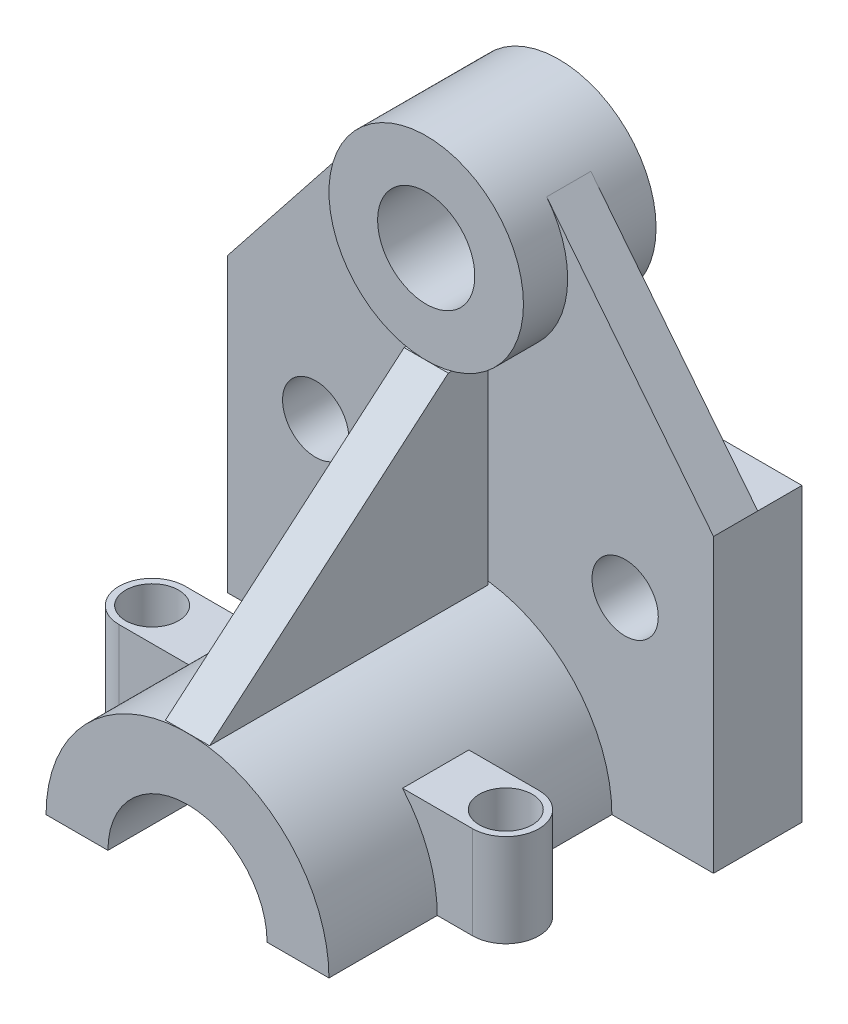
ISO-10303-21;
HEADER;
FILE_DESCRIPTION(('STEP AP214'),'2;1');
FILE_NAME('part.step','',(''),(''),'','','');
FILE_SCHEMA(('AUTOMOTIVE_DESIGN { 1 0 10303 214 1 1 1 1 }'));
ENDSEC;
DATA;
#1=APPLICATION_CONTEXT('core data for automotive mechanical design processes');
#2=APPLICATION_PROTOCOL_DEFINITION('international standard','automotive_design',2000,#1);
#3=PRODUCT_CONTEXT('',#1,'mechanical');
#4=PRODUCT('Part','Part','',(#3));
#5=PRODUCT_RELATED_PRODUCT_CATEGORY('part','',(#4));
#6=PRODUCT_DEFINITION_FORMATION('','',#4);
#7=PRODUCT_DEFINITION_CONTEXT('part definition',#1,'design');
#8=PRODUCT_DEFINITION('design','',#6,#7);
#9=PRODUCT_DEFINITION_SHAPE('','',#8);
#10=(LENGTH_UNIT() NAMED_UNIT(*) SI_UNIT(.MILLI.,.METRE.));
#11=(NAMED_UNIT(*) PLANE_ANGLE_UNIT() SI_UNIT($,.RADIAN.));
#12=(NAMED_UNIT(*) SI_UNIT($,.STERADIAN.) SOLID_ANGLE_UNIT());
#13=UNCERTAINTY_MEASURE_WITH_UNIT(LENGTH_MEASURE(1.E-05),#10,'distance_accuracy_value','');
#14=(GEOMETRIC_REPRESENTATION_CONTEXT(3) GLOBAL_UNCERTAINTY_ASSIGNED_CONTEXT((#13)) GLOBAL_UNIT_ASSIGNED_CONTEXT((#10,
#11,#12)) REPRESENTATION_CONTEXT('',''));
#15=CARTESIAN_POINT('',(0.,0.,0.));
#16=DIRECTION('',(0.,0.,1.));
#17=DIRECTION('',(1.,0.,0.));
#18=AXIS2_PLACEMENT_3D('',#15,#16,#17);
#19=CARTESIAN_POINT('',(-5.,-0.999999999999994,0.));
#20=DIRECTION('',(0.,1.,0.));
#21=DIRECTION('',(-1.,0.,0.));
#22=AXIS2_PLACEMENT_3D('',#19,#20,#21);
#23=PLANE('',#22);
#24=DIRECTION('',(0.,0.,1.));
#25=VECTOR('',#24,1.);
#26=CARTESIAN_POINT('',(-5.,-0.999999999999994,0.));
#27=LINE('',#26,#25);
#28=CARTESIAN_POINT('',(-5.,-0.999999999999994,1.00000000000001));
#29=VERTEX_POINT('',#28);
#30=CARTESIAN_POINT('',(-5.,-1.,64.));
#31=VERTEX_POINT('',#30);
#32=EDGE_CURVE('E84',#29,#31,#27,.T.);
#33=ORIENTED_EDGE('',*,*,#32,.F.);
#34=DIRECTION('',(-1.,0.,0.));
#35=VECTOR('',#34,1.);
#36=CARTESIAN_POINT('',(4.99999999999996,-0.999999999999994,1.00000000000001));
#37=LINE('',#36,#35);
#38=CARTESIAN_POINT('',(4.99999999999996,-0.999999999999994,1.00000000000001));
#39=VERTEX_POINT('',#38);
#40=EDGE_CURVE('E119',#39,#29,#37,.T.);
#41=ORIENTED_EDGE('',*,*,#40,.F.);
#42=DIRECTION('',(0.,0.,1.));
#43=VECTOR('',#42,1.);
#44=CARTESIAN_POINT('',(4.99999999999997,-0.999999999999994,0.));
#45=LINE('',#44,#43);
#46=CARTESIAN_POINT('',(4.99999999999997,-1.,64.));
#47=VERTEX_POINT('',#46);
#48=EDGE_CURVE('E108',#39,#47,#45,.T.);
#49=ORIENTED_EDGE('',*,*,#48,.T.);
#50=DIRECTION('',(1.,0.,0.));
#51=VECTOR('',#50,1.);
#52=CARTESIAN_POINT('',(-5.,-1.,64.));
#53=LINE('',#52,#51);
#54=EDGE_CURVE('E13',#31,#47,#53,.T.);
#55=ORIENTED_EDGE('',*,*,#54,.F.);
#56=EDGE_LOOP('',(#33,#41,#49,#55));
#57=FACE_BOUND('',#56,.T.);
#58=ADVANCED_FACE('F70',(#57),#23,.F.);
#59=CARTESIAN_POINT('',(-5.,31.0135132931716,26.4189176747606));
#60=DIRECTION('',(0.,0.761243243287488,0.648466440572792));
#61=DIRECTION('',(0.,-0.648466440572792,0.761243243287488));
#62=AXIS2_PLACEMENT_3D('',#59,#60,#61);
#63=PLANE('',#62);
#64=ORIENTED_EDGE('',*,*,#54,.T.);
#65=DIRECTION('',(0.,-0.648466440572792,0.761243243287488));
#66=VECTOR('',#65,1.);
#67=CARTESIAN_POINT('',(4.99999999999996,31.0135132931716,26.4189176747606));
#68=LINE('',#67,#66);
#69=CARTESIAN_POINT('',(4.99999999999996,44.9999981605174,9.99999999999999));
#70=VERTEX_POINT('',#69);
#71=EDGE_CURVE('E114',#70,#47,#68,.T.);
#72=ORIENTED_EDGE('',*,*,#71,.F.);
#73=DIRECTION('',(1.,0.,0.));
#74=VECTOR('',#73,1.);
#75=CARTESIAN_POINT('',(-5.,44.9999981605174,9.99999999999999));
#76=LINE('',#75,#74);
#77=CARTESIAN_POINT('',(-5.,44.9999981605174,9.99999999999999));
#78=VERTEX_POINT('',#77);
#79=EDGE_CURVE('E73',#78,#70,#76,.T.);
#80=ORIENTED_EDGE('',*,*,#79,.F.);
#81=DIRECTION('',(0.,-0.648466440572792,0.761243243287488));
#82=VECTOR('',#81,1.);
#83=CARTESIAN_POINT('',(-5.,31.0135132931716,26.4189176747606));
#84=LINE('',#83,#82);
#85=EDGE_CURVE('E137',#78,#31,#84,.T.);
#86=ORIENTED_EDGE('',*,*,#85,.T.);
#87=EDGE_LOOP('',(#64,#72,#80,#86));
#88=FACE_BOUND('',#87,.T.);
#89=ADVANCED_FACE('F143',(#88),#63,.T.);
#90=CARTESIAN_POINT('',(-5.,0.,0.));
#91=DIRECTION('',(1.,0.,0.));
#92=DIRECTION('',(0.,1.,0.));
#93=AXIS2_PLACEMENT_3D('',#90,#91,#92);
#94=PLANE('',#93);
#95=ORIENTED_EDGE('',*,*,#32,.T.);
#96=ORIENTED_EDGE('',*,*,#85,.F.);
#97=DIRECTION('',(0.,0.,1.));
#98=VECTOR('',#97,1.);
#99=CARTESIAN_POINT('',(-5.,44.9999981605174,1.00000000000001));
#100=LINE('',#99,#98);
#101=CARTESIAN_POINT('',(-5.,44.9999981605174,1.00000000000001));
#102=VERTEX_POINT('',#101);
#103=EDGE_CURVE('E116',#102,#78,#100,.T.);
#104=ORIENTED_EDGE('',*,*,#103,.F.);
#105=DIRECTION('',(0.,1.,0.));
#106=VECTOR('',#105,1.);
#107=CARTESIAN_POINT('',(-5.,44.9999981605174,1.00000000000001));
#108=LINE('',#107,#106);
#109=EDGE_CURVE('E121',#29,#102,#108,.T.);
#110=ORIENTED_EDGE('',*,*,#109,.F.);
#111=EDGE_LOOP('',(#95,#96,#104,#110));
#112=FACE_BOUND('',#111,.T.);
#113=ADVANCED_FACE('F145',(#112),#94,.F.);
#114=CARTESIAN_POINT('',(4.99999999999997,0.,0.));
#115=DIRECTION('',(1.,0.,0.));
#116=DIRECTION('',(0.,1.,0.));
#117=AXIS2_PLACEMENT_3D('',#114,#115,#116);
#118=PLANE('',#117);
#119=ORIENTED_EDGE('',*,*,#48,.F.);
#120=DIRECTION('',(0.,-1.,0.));
#121=VECTOR('',#120,1.);
#122=CARTESIAN_POINT('',(4.99999999999996,44.9999981605174,1.00000000000001));
#123=LINE('',#122,#121);
#124=CARTESIAN_POINT('',(4.99999999999996,44.9999981605174,1.00000000000001));
#125=VERTEX_POINT('',#124);
#126=EDGE_CURVE('E113',#125,#39,#123,.T.);
#127=ORIENTED_EDGE('',*,*,#126,.F.);
#128=DIRECTION('',(0.,0.,1.));
#129=VECTOR('',#128,1.);
#130=CARTESIAN_POINT('',(4.99999999999996,44.9999981605174,1.00000000000001));
#131=LINE('',#130,#129);
#132=EDGE_CURVE('E131',#125,#70,#131,.T.);
#133=ORIENTED_EDGE('',*,*,#132,.T.);
#134=ORIENTED_EDGE('',*,*,#71,.T.);
#135=EDGE_LOOP('',(#119,#127,#133,#134));
#136=FACE_BOUND('',#135,.T.);
#137=ADVANCED_FACE('F110',(#136),#118,.T.);
#138=CARTESIAN_POINT('',(4.99999999999996,44.9999981605174,1.00000000000001));
#139=DIRECTION('',(0.,-1.,0.));
#140=DIRECTION('',(0.,0.,-1.));
#141=AXIS2_PLACEMENT_3D('',#138,#139,#140);
#142=PLANE('',#141);
#143=ORIENTED_EDGE('',*,*,#79,.T.);
#144=ORIENTED_EDGE('',*,*,#132,.F.);
#145=DIRECTION('',(1.,0.,0.));
#146=VECTOR('',#145,1.);
#147=CARTESIAN_POINT('',(4.99999999999996,44.9999981605174,1.00000000000001));
#148=LINE('',#147,#146);
#149=EDGE_CURVE('E125',#102,#125,#148,.T.);
#150=ORIENTED_EDGE('',*,*,#149,.F.);
#151=ORIENTED_EDGE('',*,*,#103,.T.);
#152=EDGE_LOOP('',(#143,#144,#150,#151));
#153=FACE_BOUND('',#152,.T.);
#154=ADVANCED_FACE('F141',(#153),#142,.F.);
#155=CARTESIAN_POINT('',(0.,0.,1.00000000000001));
#156=DIRECTION('',(0.,0.,-1.));
#157=DIRECTION('',(-1.,0.,0.));
#158=AXIS2_PLACEMENT_3D('',#155,#156,#157);
#159=PLANE('',#158);
#160=ORIENTED_EDGE('',*,*,#126,.T.);
#161=ORIENTED_EDGE('',*,*,#40,.T.);
#162=ORIENTED_EDGE('',*,*,#109,.T.);
#163=ORIENTED_EDGE('',*,*,#149,.T.);
#164=EDGE_LOOP('',(#160,#161,#162,#163));
#165=FACE_BOUND('',#164,.T.);
#166=ADVANCED_FACE('F123',(#165),#159,.T.);
#167=CLOSED_SHELL('',(#58,#89,#113,#137,#154,#166));
#168=MANIFOLD_SOLID_BREP('B2',#167);
#169=CARTESIAN_POINT('',(0.,-33.,64.));
#170=DIRECTION('',(0.,0.,-1.));
#171=DIRECTION('',(-1.,0.,0.));
#172=AXIS2_PLACEMENT_3D('',#169,#170,#171);
#173=CYLINDRICAL_SURFACE('',#172,32.);
#174=CARTESIAN_POINT('',(0.,-33.,39.5));
#175=DIRECTION('',(0.,0.,-1.));
#176=DIRECTION('',(-1.,0.,0.));
#177=AXIS2_PLACEMENT_3D('',#174,#175,#176);
#178=CIRCLE('',#177,32.);
#179=CARTESIAN_POINT('',(-32.,-33.,39.5));
#180=VERTEX_POINT('',#179);
#181=CARTESIAN_POINT('',(-24.1453929352993,-12.,39.5));
#182=VERTEX_POINT('',#181);
#183=EDGE_CURVE('E68',#180,#182,#178,.T.);
#184=ORIENTED_EDGE('',*,*,#183,.F.);
#185=DIRECTION('',(0.,0.,-1.));
#186=VECTOR('',#185,1.);
#187=CARTESIAN_POINT('',(-32.,-33.,64.));
#188=LINE('',#187,#186);
#189=CARTESIAN_POINT('',(-32.,-33.,64.));
#190=VERTEX_POINT('',#189);
#191=EDGE_CURVE('E428',#190,#180,#188,.T.);
#192=ORIENTED_EDGE('',*,*,#191,.F.);
#193=CARTESIAN_POINT('',(0.,-33.,64.));
#194=DIRECTION('',(0.,0.,1.));
#195=DIRECTION('',(1.,0.,0.));
#196=AXIS2_PLACEMENT_3D('',#193,#194,#195);
#197=CIRCLE('',#196,32.);
#198=CARTESIAN_POINT('',(32.,-33.,64.));
#199=VERTEX_POINT('',#198);
#200=EDGE_CURVE('E408',#199,#190,#197,.T.);
#201=ORIENTED_EDGE('',*,*,#200,.F.);
#202=DIRECTION('',(0.,0.,-1.));
#203=VECTOR('',#202,1.);
#204=CARTESIAN_POINT('',(32.,-33.,64.));
#205=LINE('',#204,#203);
#206=CARTESIAN_POINT('',(32.,-33.,39.5));
#207=VERTEX_POINT('',#206);
#208=EDGE_CURVE('E510',#199,#207,#205,.T.);
#209=ORIENTED_EDGE('',*,*,#208,.T.);
#210=CARTESIAN_POINT('',(24.1453929352993,-12.,39.5));
#211=VERTEX_POINT('',#210);
#212=EDGE_CURVE('E529',#211,#207,#178,.T.);
#213=ORIENTED_EDGE('',*,*,#212,.F.);
#214=DIRECTION('',(0.,0.,-1.));
#215=VECTOR('',#214,1.);
#216=CARTESIAN_POINT('',(24.1453929352993,-12.,64.));
#217=LINE('',#216,#215);
#218=CARTESIAN_POINT('',(24.1453929352993,-12.,24.5));
#219=VERTEX_POINT('',#218);
#220=EDGE_CURVE('E345',#219,#211,#217,.F.);
#221=ORIENTED_EDGE('',*,*,#220,.F.);
#222=CARTESIAN_POINT('',(0.,-33.,24.5));
#223=DIRECTION('',(0.,0.,-1.));
#224=DIRECTION('',(-1.,0.,0.));
#225=AXIS2_PLACEMENT_3D('',#222,#223,#224);
#226=CIRCLE('',#225,32.);
#227=CARTESIAN_POINT('',(32.,-33.,24.5));
#228=VERTEX_POINT('',#227);
#229=EDGE_CURVE('E231',#219,#228,#226,.T.);
#230=ORIENTED_EDGE('',*,*,#229,.T.);
#231=CARTESIAN_POINT('',(32.,-33.,0.));
#232=VERTEX_POINT('',#231);
#233=EDGE_CURVE('E431',#228,#232,#205,.T.);
#234=ORIENTED_EDGE('',*,*,#233,.T.);
#235=CARTESIAN_POINT('',(0.,-33.,0.));
#236=DIRECTION('',(0.,0.,1.));
#237=DIRECTION('',(1.,0.,0.));
#238=AXIS2_PLACEMENT_3D('',#235,#236,#237);
#239=CIRCLE('',#238,32.);
#240=CARTESIAN_POINT('',(-32.,-33.,0.));
#241=VERTEX_POINT('',#240);
#242=EDGE_CURVE('E406',#232,#241,#239,.T.);
#243=ORIENTED_EDGE('',*,*,#242,.T.);
#244=CARTESIAN_POINT('',(-32.,-33.,24.5));
#245=VERTEX_POINT('',#244);
#246=EDGE_CURVE('E419',#245,#241,#188,.T.);
#247=ORIENTED_EDGE('',*,*,#246,.F.);
#248=CARTESIAN_POINT('',(-24.1453929352993,-12.,24.5));
#249=VERTEX_POINT('',#248);
#250=EDGE_CURVE('E525',#245,#249,#226,.T.);
#251=ORIENTED_EDGE('',*,*,#250,.T.);
#252=DIRECTION('',(0.,0.,-1.));
#253=VECTOR('',#252,1.);
#254=CARTESIAN_POINT('',(-24.1453929352993,-12.,64.));
#255=LINE('',#254,#253);
#256=EDGE_CURVE('E215',#182,#249,#255,.T.);
#257=ORIENTED_EDGE('',*,*,#256,.F.);
#258=EDGE_LOOP('',(#184,#192,#201,#209,#213,#221,#230,#234,#243,#247,#251,#257));
#259=FACE_BOUND('',#258,.T.);
#260=ADVANCED_FACE('F206',(#259),#173,.T.);
#261=CARTESIAN_POINT('',(0.,0.,0.));
#262=DIRECTION('',(0.,0.,1.));
#263=DIRECTION('',(1.,0.,0.));
#264=AXIS2_PLACEMENT_3D('',#261,#262,#263);
#265=PLANE('',#264);
#266=CARTESIAN_POINT('',(-35.,11.,0.));
#267=DIRECTION('',(0.,0.,1.));
#268=DIRECTION('',(1.,0.,0.));
#269=AXIS2_PLACEMENT_3D('',#266,#267,#268);
#270=CIRCLE('',#269,7.5);
#271=CARTESIAN_POINT('',(-27.5,11.,0.));
#272=VERTEX_POINT('',#271);
#273=EDGE_CURVE('E395',#272,#272,#270,.T.);
#274=ORIENTED_EDGE('',*,*,#273,.F.);
#275=EDGE_LOOP('',(#274));
#276=FACE_BOUND('',#275,.T.);
#277=CARTESIAN_POINT('',(35.,11.,0.));
#278=DIRECTION('',(0.,0.,1.));
#279=DIRECTION('',(1.,0.,0.));
#280=AXIS2_PLACEMENT_3D('',#277,#278,#279);
#281=CIRCLE('',#280,7.5);
#282=CARTESIAN_POINT('',(42.5,11.,0.));
#283=VERTEX_POINT('',#282);
#284=EDGE_CURVE('E399',#283,#283,#281,.T.);
#285=ORIENTED_EDGE('',*,*,#284,.F.);
#286=EDGE_LOOP('',(#285));
#287=FACE_BOUND('',#286,.T.);
#288=DIRECTION('',(1.,0.,0.));
#289=VECTOR('',#288,1.);
#290=CARTESIAN_POINT('',(-55.,-33.,0.));
#291=LINE('',#290,#289);
#292=CARTESIAN_POINT('',(-55.,-33.,0.));
#293=VERTEX_POINT('',#292);
#294=EDGE_CURVE('E450',#293,#241,#291,.T.);
#295=ORIENTED_EDGE('',*,*,#294,.T.);
#296=ORIENTED_EDGE('',*,*,#242,.F.);
#297=CARTESIAN_POINT('',(55.,-33.,0.));
#298=VERTEX_POINT('',#297);
#299=EDGE_CURVE('E455',#232,#298,#291,.T.);
#300=ORIENTED_EDGE('',*,*,#299,.T.);
#301=DIRECTION('',(0.,1.,0.));
#302=VECTOR('',#301,1.);
#303=CARTESIAN_POINT('',(55.,33.,0.));
#304=LINE('',#303,#302);
#305=CARTESIAN_POINT('',(55.,33.,0.));
#306=VERTEX_POINT('',#305);
#307=EDGE_CURVE('E459',#298,#306,#304,.T.);
#308=ORIENTED_EDGE('',*,*,#307,.T.);
#309=DIRECTION('',(-0.620943010245039,0.783855712505707,0.));
#310=VECTOR('',#309,1.);
#311=CARTESIAN_POINT('',(49.8557187403257,39.4939522397401,0.));
#312=LINE('',#311,#310);
#313=CARTESIAN_POINT('',(17.2448271170145,80.6607473676047,0.));
#314=VERTEX_POINT('',#313);
#315=EDGE_CURVE('E486',#306,#314,#312,.T.);
#316=ORIENTED_EDGE('',*,*,#315,.T.);
#317=CARTESIAN_POINT('',(0.,67.,0.));
#318=DIRECTION('',(0.,0.,1.));
#319=DIRECTION('',(1.,0.,0.));
#320=AXIS2_PLACEMENT_3D('',#317,#318,#319);
#321=CIRCLE('',#320,22.0000018394826);
#322=CARTESIAN_POINT('',(-17.2448271170145,80.6607473676047,0.));
#323=VERTEX_POINT('',#322);
#324=EDGE_CURVE('E489',#314,#323,#321,.F.);
#325=ORIENTED_EDGE('',*,*,#324,.T.);
#326=DIRECTION('',(-0.620943010245039,-0.783855712505707,0.));
#327=VECTOR('',#326,1.);
#328=CARTESIAN_POINT('',(-49.8557187403257,39.4939522397401,0.));
#329=LINE('',#328,#327);
#330=CARTESIAN_POINT('',(-55.,33.,0.));
#331=VERTEX_POINT('',#330);
#332=EDGE_CURVE('E482',#323,#331,#329,.T.);
#333=ORIENTED_EDGE('',*,*,#332,.T.);
#334=DIRECTION('',(0.,-1.,0.));
#335=VECTOR('',#334,1.);
#336=CARTESIAN_POINT('',(-55.,33.,0.));
#337=LINE('',#336,#335);
#338=EDGE_CURVE('E456',#331,#293,#337,.T.);
#339=ORIENTED_EDGE('',*,*,#338,.T.);
#340=EDGE_LOOP('',(#295,#296,#300,#308,#316,#325,#333,#339));
#341=FACE_BOUND('',#340,.T.);
#342=ADVANCED_FACE('F560',(#276,#287,#341),#265,.T.);
#343=CARTESIAN_POINT('',(55.,33.,-20.));
#344=DIRECTION('',(1.,0.,0.));
#345=DIRECTION('',(0.,1.,0.));
#346=AXIS2_PLACEMENT_3D('',#343,#344,#345);
#347=PLANE('',#346);
#348=ORIENTED_EDGE('',*,*,#307,.F.);
#349=DIRECTION('',(0.,0.,1.));
#350=VECTOR('',#349,1.);
#351=CARTESIAN_POINT('',(55.,-33.,-20.));
#352=LINE('',#351,#350);
#353=CARTESIAN_POINT('',(55.,-33.,-20.));
#354=VERTEX_POINT('',#353);
#355=EDGE_CURVE('E439',#354,#298,#352,.T.);
#356=ORIENTED_EDGE('',*,*,#355,.F.);
#357=DIRECTION('',(0.,1.,0.));
#358=VECTOR('',#357,1.);
#359=CARTESIAN_POINT('',(55.,33.,-20.));
#360=LINE('',#359,#358);
#361=CARTESIAN_POINT('',(55.,33.,-20.));
#362=VERTEX_POINT('',#361);
#363=EDGE_CURVE('E453',#354,#362,#360,.T.);
#364=ORIENTED_EDGE('',*,*,#363,.T.);
#365=DIRECTION('',(0.,0.,1.));
#366=VECTOR('',#365,1.);
#367=CARTESIAN_POINT('',(55.,33.,-20.));
#368=LINE('',#367,#366);
#369=CARTESIAN_POINT('',(55.,33.,-9.99999999999999));
#370=VERTEX_POINT('',#369);
#371=EDGE_CURVE('E440',#362,#370,#368,.T.);
#372=ORIENTED_EDGE('',*,*,#371,.T.);
#373=DIRECTION('',(0.,0.,1.));
#374=VECTOR('',#373,1.);
#375=CARTESIAN_POINT('',(55.,33.,-9.99999999999999));
#376=LINE('',#375,#374);
#377=EDGE_CURVE('E462',#370,#306,#376,.T.);
#378=ORIENTED_EDGE('',*,*,#377,.T.);
#379=EDGE_LOOP('',(#348,#356,#364,#372,#378));
#380=FACE_BOUND('',#379,.T.);
#381=ADVANCED_FACE('F208',(#380),#347,.T.);
#382=CARTESIAN_POINT('',(-55.,-33.,-20.));
#383=DIRECTION('',(0.,-1.,0.));
#384=DIRECTION('',(0.,0.,-1.));
#385=AXIS2_PLACEMENT_3D('',#382,#383,#384);
#386=PLANE('',#385);
#387=CARTESIAN_POINT('',(-40.,-33.,32.));
#388=DIRECTION('',(0.,1.,0.));
#389=DIRECTION('',(0.,0.,1.));
#390=AXIS2_PLACEMENT_3D('',#387,#388,#389);
#391=CIRCLE('',#390,6.);
#392=CARTESIAN_POINT('',(-40.,-33.,38.));
#393=VERTEX_POINT('',#392);
#394=EDGE_CURVE('E373',#393,#393,#391,.T.);
#395=ORIENTED_EDGE('',*,*,#394,.T.);
#396=EDGE_LOOP('',(#395));
#397=FACE_BOUND('',#396,.T.);
#398=CARTESIAN_POINT('',(40.,-33.,32.));
#399=DIRECTION('',(0.,1.,0.));
#400=DIRECTION('',(0.,0.,1.));
#401=AXIS2_PLACEMENT_3D('',#398,#399,#400);
#402=CIRCLE('',#401,6.);
#403=CARTESIAN_POINT('',(40.,-33.,38.));
#404=VERTEX_POINT('',#403);
#405=EDGE_CURVE('E659',#404,#404,#402,.T.);
#406=ORIENTED_EDGE('',*,*,#405,.T.);
#407=EDGE_LOOP('',(#406));
#408=FACE_BOUND('',#407,.T.);
#409=DIRECTION('',(0.,0.,-1.));
#410=VECTOR('',#409,1.);
#411=CARTESIAN_POINT('',(18.,-33.,64.));
#412=LINE('',#411,#410);
#413=CARTESIAN_POINT('',(18.,-33.,64.));
#414=VERTEX_POINT('',#413);
#415=CARTESIAN_POINT('',(18.,-33.,0.));
#416=VERTEX_POINT('',#415);
#417=EDGE_CURVE('E509',#414,#416,#412,.T.);
#418=ORIENTED_EDGE('',*,*,#417,.T.);
#419=CARTESIAN_POINT('',(-18.,-33.,0.));
#420=VERTEX_POINT('',#419);
#421=EDGE_CURVE('E454',#420,#416,#291,.T.);
#422=ORIENTED_EDGE('',*,*,#421,.F.);
#423=DIRECTION('',(0.,0.,-1.));
#424=VECTOR('',#423,1.);
#425=CARTESIAN_POINT('',(-18.,-33.,64.));
#426=LINE('',#425,#424);
#427=CARTESIAN_POINT('',(-18.,-33.,64.));
#428=VERTEX_POINT('',#427);
#429=EDGE_CURVE('E417',#428,#420,#426,.T.);
#430=ORIENTED_EDGE('',*,*,#429,.F.);
#431=DIRECTION('',(1.,0.,0.));
#432=VECTOR('',#431,1.);
#433=CARTESIAN_POINT('',(0.,-33.,64.));
#434=LINE('',#433,#432);
#435=EDGE_CURVE('E409',#190,#428,#434,.T.);
#436=ORIENTED_EDGE('',*,*,#435,.F.);
#437=ORIENTED_EDGE('',*,*,#191,.T.);
#438=DIRECTION('',(1.,0.,0.));
#439=VECTOR('',#438,1.);
#440=CARTESIAN_POINT('',(0.,-33.,39.5));
#441=LINE('',#440,#439);
#442=CARTESIAN_POINT('',(-40.,-33.,39.5));
#443=VERTEX_POINT('',#442);
#444=EDGE_CURVE('E374',#443,#180,#441,.T.);
#445=ORIENTED_EDGE('',*,*,#444,.F.);
#446=CARTESIAN_POINT('',(-40.,-33.,32.));
#447=DIRECTION('',(0.,-1.,0.));
#448=DIRECTION('',(0.,0.,-1.));
#449=AXIS2_PLACEMENT_3D('',#446,#447,#448);
#450=CIRCLE('',#449,7.5);
#451=CARTESIAN_POINT('',(-40.,-33.,24.5));
#452=VERTEX_POINT('',#451);
#453=EDGE_CURVE('E381',#443,#452,#450,.T.);
#454=ORIENTED_EDGE('',*,*,#453,.T.);
#455=DIRECTION('',(-1.,0.,0.));
#456=VECTOR('',#455,1.);
#457=CARTESIAN_POINT('',(0.,-33.,24.5));
#458=LINE('',#457,#456);
#459=EDGE_CURVE('E380',#245,#452,#458,.T.);
#460=ORIENTED_EDGE('',*,*,#459,.F.);
#461=ORIENTED_EDGE('',*,*,#246,.T.);
#462=ORIENTED_EDGE('',*,*,#294,.F.);
#463=DIRECTION('',(0.,0.,1.));
#464=VECTOR('',#463,1.);
#465=CARTESIAN_POINT('',(-55.,-33.,-20.));
#466=LINE('',#465,#464);
#467=CARTESIAN_POINT('',(-55.,-33.,-20.));
#468=VERTEX_POINT('',#467);
#469=EDGE_CURVE('E446',#468,#293,#466,.T.);
#470=ORIENTED_EDGE('',*,*,#469,.F.);
#471=DIRECTION('',(1.,0.,0.));
#472=VECTOR('',#471,1.);
#473=CARTESIAN_POINT('',(-55.,-33.,-20.));
#474=LINE('',#473,#472);
#475=EDGE_CURVE('E444',#468,#354,#474,.T.);
#476=ORIENTED_EDGE('',*,*,#475,.T.);
#477=ORIENTED_EDGE('',*,*,#355,.T.);
#478=ORIENTED_EDGE('',*,*,#299,.F.);
#479=ORIENTED_EDGE('',*,*,#233,.F.);
#480=DIRECTION('',(-1.,0.,0.));
#481=VECTOR('',#480,1.);
#482=CARTESIAN_POINT('',(0.,-33.,24.5));
#483=LINE('',#482,#481);
#484=CARTESIAN_POINT('',(40.,-33.,24.5));
#485=VERTEX_POINT('',#484);
#486=EDGE_CURVE('E364',#485,#228,#483,.T.);
#487=ORIENTED_EDGE('',*,*,#486,.F.);
#488=CARTESIAN_POINT('',(40.,-33.,32.));
#489=DIRECTION('',(0.,-1.,0.));
#490=DIRECTION('',(0.,0.,-1.));
#491=AXIS2_PLACEMENT_3D('',#488,#489,#490);
#492=CIRCLE('',#491,7.5);
#493=CARTESIAN_POINT('',(40.,-33.,39.5));
#494=VERTEX_POINT('',#493);
#495=EDGE_CURVE('E371',#485,#494,#492,.T.);
#496=ORIENTED_EDGE('',*,*,#495,.T.);
#497=DIRECTION('',(1.,0.,0.));
#498=VECTOR('',#497,1.);
#499=CARTESIAN_POINT('',(0.,-33.,39.5));
#500=LINE('',#499,#498);
#501=EDGE_CURVE('E356',#207,#494,#500,.T.);
#502=ORIENTED_EDGE('',*,*,#501,.F.);
#503=ORIENTED_EDGE('',*,*,#208,.F.);
#504=EDGE_CURVE('E405',#414,#199,#434,.T.);
#505=ORIENTED_EDGE('',*,*,#504,.F.);
#506=EDGE_LOOP('',(#418,#422,#430,#436,#437,#445,#454,#460,#461,#462,#470,#476,#477,#478,#479,
#487,#496,#502,#503,#505));
#507=FACE_BOUND('',#506,.T.);
#508=ADVANCED_FACE('F545',(#397,#408,#507),#386,.T.);
#509=CARTESIAN_POINT('',(-55.,33.,-20.));
#510=DIRECTION('',(-1.,0.,0.));
#511=DIRECTION('',(0.,-1.,0.));
#512=AXIS2_PLACEMENT_3D('',#509,#510,#511);
#513=PLANE('',#512);
#514=ORIENTED_EDGE('',*,*,#338,.F.);
#515=DIRECTION('',(0.,0.,1.));
#516=VECTOR('',#515,1.);
#517=CARTESIAN_POINT('',(-55.,33.,-9.99999999999999));
#518=LINE('',#517,#516);
#519=CARTESIAN_POINT('',(-55.,33.,-9.99999999999999));
#520=VERTEX_POINT('',#519);
#521=EDGE_CURVE('E478',#520,#331,#518,.T.);
#522=ORIENTED_EDGE('',*,*,#521,.F.);
#523=DIRECTION('',(0.,0.,1.));
#524=VECTOR('',#523,1.);
#525=CARTESIAN_POINT('',(-55.,33.,-20.));
#526=LINE('',#525,#524);
#527=CARTESIAN_POINT('',(-55.,33.,-20.));
#528=VERTEX_POINT('',#527);
#529=EDGE_CURVE('E443',#528,#520,#526,.T.);
#530=ORIENTED_EDGE('',*,*,#529,.F.);
#531=DIRECTION('',(0.,-1.,0.));
#532=VECTOR('',#531,1.);
#533=CARTESIAN_POINT('',(-55.,33.,-20.));
#534=LINE('',#533,#532);
#535=EDGE_CURVE('E464',#528,#468,#534,.T.);
#536=ORIENTED_EDGE('',*,*,#535,.T.);
#537=ORIENTED_EDGE('',*,*,#469,.T.);
#538=EDGE_LOOP('',(#514,#522,#530,#536,#537));
#539=FACE_BOUND('',#538,.T.);
#540=ADVANCED_FACE('F643',(#539),#513,.T.);
#541=CARTESIAN_POINT('',(-55.,33.,-20.));
#542=DIRECTION('',(0.,1.,0.));
#543=DIRECTION('',(0.,0.,1.));
#544=AXIS2_PLACEMENT_3D('',#541,#542,#543);
#545=PLANE('',#544);
#546=DIRECTION('',(-1.,0.,0.));
#547=VECTOR('',#546,1.);
#548=CARTESIAN_POINT('',(0.,33.,-9.99999999999999));
#549=LINE('',#548,#547);
#550=EDGE_CURVE('E475',#370,#520,#549,.T.);
#551=ORIENTED_EDGE('',*,*,#550,.F.);
#552=ORIENTED_EDGE('',*,*,#371,.F.);
#553=DIRECTION('',(-1.,0.,0.));
#554=VECTOR('',#553,1.);
#555=CARTESIAN_POINT('',(-55.,33.,-20.));
#556=LINE('',#555,#554);
#557=EDGE_CURVE('E467',#362,#528,#556,.T.);
#558=ORIENTED_EDGE('',*,*,#557,.T.);
#559=ORIENTED_EDGE('',*,*,#529,.T.);
#560=EDGE_LOOP('',(#551,#552,#558,#559));
#561=FACE_BOUND('',#560,.T.);
#562=ADVANCED_FACE('F587',(#561),#545,.T.);
#563=CARTESIAN_POINT('',(0.,0.,-20.));
#564=DIRECTION('',(0.,0.,1.));
#565=DIRECTION('',(1.,0.,0.));
#566=AXIS2_PLACEMENT_3D('',#563,#564,#565);
#567=PLANE('',#566);
#568=CARTESIAN_POINT('',(-35.,11.,-20.));
#569=DIRECTION('',(0.,0.,1.));
#570=DIRECTION('',(1.,0.,0.));
#571=AXIS2_PLACEMENT_3D('',#568,#569,#570);
#572=CIRCLE('',#571,7.5);
#573=CARTESIAN_POINT('',(-27.5,11.,-20.));
#574=VERTEX_POINT('',#573);
#575=EDGE_CURVE('E414',#574,#574,#572,.T.);
#576=ORIENTED_EDGE('',*,*,#575,.T.);
#577=EDGE_LOOP('',(#576));
#578=FACE_BOUND('',#577,.T.);
#579=CARTESIAN_POINT('',(35.,11.,-20.));
#580=DIRECTION('',(0.,0.,1.));
#581=DIRECTION('',(1.,0.,0.));
#582=AXIS2_PLACEMENT_3D('',#579,#580,#581);
#583=CIRCLE('',#582,7.5);
#584=CARTESIAN_POINT('',(42.5,11.,-20.));
#585=VERTEX_POINT('',#584);
#586=EDGE_CURVE('E398',#585,#585,#583,.T.);
#587=ORIENTED_EDGE('',*,*,#586,.T.);
#588=EDGE_LOOP('',(#587));
#589=FACE_BOUND('',#588,.T.);
#590=ORIENTED_EDGE('',*,*,#363,.F.);
#591=ORIENTED_EDGE('',*,*,#475,.F.);
#592=ORIENTED_EDGE('',*,*,#535,.F.);
#593=ORIENTED_EDGE('',*,*,#557,.F.);
#594=EDGE_LOOP('',(#590,#591,#592,#593));
#595=FACE_BOUND('',#594,.T.);
#596=ADVANCED_FACE('F576',(#578,#589,#595),#567,.F.);
#597=CARTESIAN_POINT('',(0.,-33.,0.));
#598=DIRECTION('',(0.,0.,1.));
#599=DIRECTION('',(1.,0.,0.));
#600=AXIS2_PLACEMENT_3D('',#597,#598,#599);
#601=CIRCLE('',#600,18.);
#602=EDGE_CURVE('E411',#416,#420,#601,.T.);
#603=ORIENTED_EDGE('',*,*,#602,.T.);
#604=ORIENTED_EDGE('',*,*,#421,.T.);
#605=EDGE_LOOP('',(#603,#604));
#606=FACE_BOUND('',#605,.T.);
#607=ADVANCED_FACE('F573',(#606),#265,.T.);
#608=CARTESIAN_POINT('',(0.,67.,-9.99999999999999));
#609=DIRECTION('',(0.,0.,1.));
#610=DIRECTION('',(1.,0.,0.));
#611=AXIS2_PLACEMENT_3D('',#608,#609,#610);
#612=CYLINDRICAL_SURFACE('',#611,22.0000018394826);
#613=DIRECTION('',(0.,0.,1.));
#614=VECTOR('',#613,1.);
#615=CARTESIAN_POINT('',(-17.2448271170145,80.6607473676047,-9.99999999999999));
#616=LINE('',#615,#614);
#617=CARTESIAN_POINT('',(-17.2448271170145,80.6607473676047,-9.99999999999999));
#618=VERTEX_POINT('',#617);
#619=EDGE_CURVE('E474',#618,#323,#616,.T.);
#620=ORIENTED_EDGE('',*,*,#619,.T.);
#621=ORIENTED_EDGE('',*,*,#324,.F.);
#622=DIRECTION('',(0.,0.,1.));
#623=VECTOR('',#622,1.);
#624=CARTESIAN_POINT('',(17.2448271170145,80.6607473676047,-9.99999999999999));
#625=LINE('',#624,#623);
#626=CARTESIAN_POINT('',(17.2448271170145,80.6607473676047,-9.99999999999999));
#627=VERTEX_POINT('',#626);
#628=EDGE_CURVE('E471',#627,#314,#625,.T.);
#629=ORIENTED_EDGE('',*,*,#628,.F.);
#630=CARTESIAN_POINT('',(0.,67.,-9.99999999999999));
#631=DIRECTION('',(0.,0.,1.));
#632=DIRECTION('',(1.,0.,0.));
#633=AXIS2_PLACEMENT_3D('',#630,#631,#632);
#634=CIRCLE('',#633,22.0000018394826);
#635=EDGE_CURVE('E436',#627,#618,#634,.F.);
#636=ORIENTED_EDGE('',*,*,#635,.T.);
#637=EDGE_LOOP('',(#620,#621,#629,#636));
#638=FACE_BOUND('',#637,.T.);
#639=CARTESIAN_POINT('',(0.,67.,-19.9999999999999));
#640=DIRECTION('',(0.,0.,1.));
#641=DIRECTION('',(1.,0.,0.));
#642=AXIS2_PLACEMENT_3D('',#639,#640,#641);
#643=CIRCLE('',#642,22.0000018394826);
#644=CARTESIAN_POINT('',(22.0000018394826,67.,-19.9999999999999));
#645=VERTEX_POINT('',#644);
#646=EDGE_CURVE('E507',#645,#645,#643,.T.);
#647=ORIENTED_EDGE('',*,*,#646,.T.);
#648=EDGE_LOOP('',(#647));
#649=FACE_BOUND('',#648,.T.);
#650=CARTESIAN_POINT('',(0.,67.,9.99999999999999));
#651=DIRECTION('',(0.,0.,1.));
#652=DIRECTION('',(1.,0.,0.));
#653=AXIS2_PLACEMENT_3D('',#650,#651,#652);
#654=CIRCLE('',#653,22.0000018394826);
#655=CARTESIAN_POINT('',(22.0000018394826,67.,9.99999999999999));
#656=VERTEX_POINT('',#655);
#657=EDGE_CURVE('E501',#656,#656,#654,.T.);
#658=ORIENTED_EDGE('',*,*,#657,.F.);
#659=EDGE_LOOP('',(#658));
#660=FACE_BOUND('',#659,.T.);
#661=ADVANCED_FACE('F575',(#638,#649,#660),#612,.T.);
#662=CARTESIAN_POINT('',(49.8557187403257,39.4939522397401,-9.99999999999999));
#663=DIRECTION('',(0.783855712505707,0.620943010245039,0.));
#664=DIRECTION('',(-0.620943010245039,0.783855712505707,0.));
#665=AXIS2_PLACEMENT_3D('',#662,#663,#664);
#666=PLANE('',#665);
#667=ORIENTED_EDGE('',*,*,#315,.F.);
#668=ORIENTED_EDGE('',*,*,#377,.F.);
#669=DIRECTION('',(-0.620943010245039,0.783855712505707,0.));
#670=VECTOR('',#669,1.);
#671=CARTESIAN_POINT('',(49.8557187403257,39.4939522397401,-9.99999999999999));
#672=LINE('',#671,#670);
#673=EDGE_CURVE('E485',#370,#627,#672,.T.);
#674=ORIENTED_EDGE('',*,*,#673,.T.);
#675=ORIENTED_EDGE('',*,*,#628,.T.);
#676=EDGE_LOOP('',(#667,#668,#674,#675));
#677=FACE_BOUND('',#676,.T.);
#678=ADVANCED_FACE('F578',(#677),#666,.T.);
#679=CARTESIAN_POINT('',(-49.8557187403257,39.4939522397401,-9.99999999999999));
#680=DIRECTION('',(-0.783855712505707,0.620943010245039,0.));
#681=DIRECTION('',(-0.620943010245039,-0.783855712505707,0.));
#682=AXIS2_PLACEMENT_3D('',#679,#680,#681);
#683=PLANE('',#682);
#684=ORIENTED_EDGE('',*,*,#332,.F.);
#685=ORIENTED_EDGE('',*,*,#619,.F.);
#686=DIRECTION('',(-0.620943010245039,-0.783855712505707,0.));
#687=VECTOR('',#686,1.);
#688=CARTESIAN_POINT('',(-49.8557187403257,39.4939522397401,-9.99999999999999));
#689=LINE('',#688,#687);
#690=EDGE_CURVE('E492',#618,#520,#689,.T.);
#691=ORIENTED_EDGE('',*,*,#690,.T.);
#692=ORIENTED_EDGE('',*,*,#521,.T.);
#693=EDGE_LOOP('',(#684,#685,#691,#692));
#694=FACE_BOUND('',#693,.T.);
#695=ADVANCED_FACE('F594',(#694),#683,.T.);
#696=CARTESIAN_POINT('',(0.,0.,-9.99999999999999));
#697=DIRECTION('',(0.,0.,1.));
#698=DIRECTION('',(1.,0.,0.));
#699=AXIS2_PLACEMENT_3D('',#696,#697,#698);
#700=PLANE('',#699);
#701=ORIENTED_EDGE('',*,*,#635,.F.);
#702=ORIENTED_EDGE('',*,*,#673,.F.);
#703=ORIENTED_EDGE('',*,*,#550,.T.);
#704=ORIENTED_EDGE('',*,*,#690,.F.);
#705=EDGE_LOOP('',(#701,#702,#703,#704));
#706=FACE_BOUND('',#705,.T.);
#707=ADVANCED_FACE('F586',(#706),#700,.F.);
#708=CARTESIAN_POINT('',(0.,0.,-19.9999999999999));
#709=DIRECTION('',(0.,0.,1.));
#710=DIRECTION('',(1.,0.,0.));
#711=AXIS2_PLACEMENT_3D('',#708,#709,#710);
#712=PLANE('',#711);
#713=ORIENTED_EDGE('',*,*,#646,.F.);
#714=EDGE_LOOP('',(#713));
#715=FACE_BOUND('',#714,.T.);
#716=CARTESIAN_POINT('',(0.,67.,-19.9999999999999));
#717=DIRECTION('',(0.,0.,1.));
#718=DIRECTION('',(1.,0.,0.));
#719=AXIS2_PLACEMENT_3D('',#716,#717,#718);
#720=CIRCLE('',#719,11.);
#721=CARTESIAN_POINT('',(-11.,67.,-20.));
#722=VERTEX_POINT('',#721);
#723=EDGE_CURVE('E504',#722,#722,#720,.T.);
#724=ORIENTED_EDGE('',*,*,#723,.T.);
#725=EDGE_LOOP('',(#724));
#726=FACE_BOUND('',#725,.T.);
#727=ADVANCED_FACE('F585',(#715,#726),#712,.F.);
#728=CARTESIAN_POINT('',(0.,67.,9.99999999999999));
#729=DIRECTION('',(0.,0.,-1.));
#730=DIRECTION('',(-1.,0.,0.));
#731=AXIS2_PLACEMENT_3D('',#728,#729,#730);
#732=CYLINDRICAL_SURFACE('',#731,11.);
#733=CARTESIAN_POINT('',(0.,67.,9.99999999999999));
#734=DIRECTION('',(0.,0.,1.));
#735=DIRECTION('',(1.,0.,0.));
#736=AXIS2_PLACEMENT_3D('',#733,#734,#735);
#737=CIRCLE('',#736,11.);
#738=CARTESIAN_POINT('',(-11.,67.,9.99999999999999));
#739=VERTEX_POINT('',#738);
#740=EDGE_CURVE('E498',#739,#739,#737,.T.);
#741=CARTESIAN_POINT('',(-11.,67.,-20.));
#742=CARTESIAN_POINT('',(-11.,67.,-19.6875));
#743=CARTESIAN_POINT('',(-11.,67.,-19.375));
#744=CARTESIAN_POINT('',(-11.,67.,-18.75));
#745=CARTESIAN_POINT('',(-11.,67.,-18.4375));
#746=CARTESIAN_POINT('',(-11.,67.,-17.8125));
#747=CARTESIAN_POINT('',(-11.,67.,-17.5));
#748=CARTESIAN_POINT('',(-11.,67.,-16.875));
#749=CARTESIAN_POINT('',(-11.,67.,-16.5625));
#750=CARTESIAN_POINT('',(-11.,67.,-15.9375));
#751=CARTESIAN_POINT('',(-11.,67.,-15.625));
#752=CARTESIAN_POINT('',(-11.,67.,-15.));
#753=CARTESIAN_POINT('',(-11.,67.,-14.6875));
#754=CARTESIAN_POINT('',(-11.,67.,-14.0625));
#755=CARTESIAN_POINT('',(-11.,67.,-13.75));
#756=CARTESIAN_POINT('',(-11.,67.,-13.125));
#757=CARTESIAN_POINT('',(-11.,67.,-12.8125));
#758=CARTESIAN_POINT('',(-11.,67.,-12.1875));
#759=CARTESIAN_POINT('',(-11.,67.,-11.875));
#760=CARTESIAN_POINT('',(-11.,67.,-11.25));
#761=CARTESIAN_POINT('',(-11.,67.,-10.9375));
#762=CARTESIAN_POINT('',(-11.,67.,-10.3125));
#763=CARTESIAN_POINT('',(-11.,67.,-9.99999999999997));
#764=CARTESIAN_POINT('',(-11.,67.,-9.37499999999997));
#765=CARTESIAN_POINT('',(-11.,67.,-9.06249999999997));
#766=CARTESIAN_POINT('',(-11.,67.,-8.43749999999998));
#767=CARTESIAN_POINT('',(-11.,67.,-8.12499999999998));
#768=CARTESIAN_POINT('',(-11.,67.,-7.49999999999998));
#769=CARTESIAN_POINT('',(-11.,67.,-7.18749999999998));
#770=CARTESIAN_POINT('',(-11.,67.,-6.56249999999998));
#771=CARTESIAN_POINT('',(-11.,67.,-6.24999999999998));
#772=CARTESIAN_POINT('',(-11.,67.,-5.62499999999998));
#773=CARTESIAN_POINT('',(-11.,67.,-5.31249999999998));
#774=CARTESIAN_POINT('',(-11.,67.,-4.68749999999998));
#775=CARTESIAN_POINT('',(-11.,67.,-4.37499999999998));
#776=CARTESIAN_POINT('',(-11.,67.,-3.74999999999999));
#777=CARTESIAN_POINT('',(-11.,67.,-3.43749999999999));
#778=CARTESIAN_POINT('',(-11.,67.,-2.81249999999999));
#779=CARTESIAN_POINT('',(-11.,67.,-2.49999999999999));
#780=CARTESIAN_POINT('',(-11.,67.,-1.87499999999999));
#781=CARTESIAN_POINT('',(-11.,67.,-1.56249999999999));
#782=CARTESIAN_POINT('',(-11.,67.,-0.93749999999999));
#783=CARTESIAN_POINT('',(-11.,67.,-0.624999999999991));
#784=CARTESIAN_POINT('',(-11.,67.,0.));
#785=CARTESIAN_POINT('',(-11.,67.,0.312500000000009));
#786=CARTESIAN_POINT('',(-11.,67.,0.937500000000008));
#787=CARTESIAN_POINT('',(-11.,67.,1.25000000000001));
#788=CARTESIAN_POINT('',(-11.,67.,1.87500000000001));
#789=CARTESIAN_POINT('',(-11.,67.,2.1875));
#790=CARTESIAN_POINT('',(-11.,67.,2.8125));
#791=CARTESIAN_POINT('',(-11.,67.,3.125));
#792=CARTESIAN_POINT('',(-11.,67.,3.75));
#793=CARTESIAN_POINT('',(-11.,67.,4.0625));
#794=CARTESIAN_POINT('',(-11.,67.,4.6875));
#795=CARTESIAN_POINT('',(-11.,67.,5.));
#796=CARTESIAN_POINT('',(-11.,67.,5.625));
#797=CARTESIAN_POINT('',(-11.,67.,5.9375));
#798=CARTESIAN_POINT('',(-11.,67.,6.56249999999999));
#799=CARTESIAN_POINT('',(-11.,67.,6.87499999999999));
#800=CARTESIAN_POINT('',(-11.,67.,7.49999999999999));
#801=CARTESIAN_POINT('',(-11.,67.,7.81249999999999));
#802=CARTESIAN_POINT('',(-11.,67.,8.43749999999999));
#803=CARTESIAN_POINT('',(-11.,67.,8.74999999999999));
#804=CARTESIAN_POINT('',(-11.,67.,9.37499999999999));
#805=CARTESIAN_POINT('',(-11.,67.,9.68749999999999));
#806=CARTESIAN_POINT('',(-11.,67.,9.99999999999999));
#807=B_SPLINE_CURVE_WITH_KNOTS('',3,(#741,#742,#743,#744,#745,#746,#747,#748,#749,#750,#751,
#752,#753,#754,#755,#756,#757,#758,#759,#760,#761,#762,#763,#764,#765,#766,#767,#768,#769,#770,
#771,#772,#773,#774,#775,#776,#777,#778,#779,#780,#781,#782,#783,#784,#785,#786,#787,#788,#789,
#790,#791,#792,#793,#794,#795,#796,#797,#798,#799,#800,#801,#802,#803,#804,#805,#806),
.UNSPECIFIED.,.F.,.F.,(4,2,2,2,2,2,2,2,2,2,2,2,2,2,2,2,2,2,2,2,2,2,2,2,2,2,2,2,2,2,2,2,4),(0.,
0.937499999999997,1.87499999999999,2.8125,3.74999999999999,4.68749999999999,5.62499999999999,
6.56249999999999,7.49999999999999,8.43749999999998,9.37499999999998,10.3125,11.25,12.1875,
13.125,14.0625,15.,15.9375,16.875,17.8125,18.75,19.6875,20.625,21.5625,22.5,23.4375,24.375,
25.3125,26.2499999999999,27.1874999999999,28.1249999999999,29.0624999999999,29.9999999999999),.UNSPECIFIED.);
#808=EDGE_CURVE('BSEAM609',#722,#739,#807,.T.);
#809=ORIENTED_EDGE('',*,*,#723,.F.);
#810=ORIENTED_EDGE('',*,*,#740,.T.);
#811=ORIENTED_EDGE('',*,*,#808,.T.);
#812=ORIENTED_EDGE('',*,*,#808,.F.);
#813=EDGE_LOOP('',(#809,#811,#810,#812));
#814=FACE_BOUND('',#813,.T.);
#815=ADVANCED_FACE('F609',(#814),#732,.F.);
#816=CARTESIAN_POINT('',(0.,0.,9.99999999999999));
#817=DIRECTION('',(0.,0.,1.));
#818=DIRECTION('',(1.,0.,0.));
#819=AXIS2_PLACEMENT_3D('',#816,#817,#818);
#820=PLANE('',#819);
#821=ORIENTED_EDGE('',*,*,#657,.T.);
#822=EDGE_LOOP('',(#821));
#823=FACE_BOUND('',#822,.T.);
#824=ORIENTED_EDGE('',*,*,#740,.F.);
#825=EDGE_LOOP('',(#824));
#826=FACE_BOUND('',#825,.T.);
#827=ADVANCED_FACE('F606',(#823,#826),#820,.T.);
#828=CARTESIAN_POINT('',(0.,-33.,64.));
#829=DIRECTION('',(0.,0.,-1.));
#830=DIRECTION('',(-1.,0.,0.));
#831=AXIS2_PLACEMENT_3D('',#828,#829,#830);
#832=CYLINDRICAL_SURFACE('',#831,18.);
#833=ORIENTED_EDGE('',*,*,#429,.T.);
#834=ORIENTED_EDGE('',*,*,#602,.F.);
#835=ORIENTED_EDGE('',*,*,#417,.F.);
#836=CARTESIAN_POINT('',(0.,-33.,64.));
#837=DIRECTION('',(0.,0.,1.));
#838=DIRECTION('',(1.,0.,0.));
#839=AXIS2_PLACEMENT_3D('',#836,#837,#838);
#840=CIRCLE('',#839,18.);
#841=EDGE_CURVE('E402',#414,#428,#840,.T.);
#842=ORIENTED_EDGE('',*,*,#841,.T.);
#843=EDGE_LOOP('',(#833,#834,#835,#842));
#844=FACE_BOUND('',#843,.T.);
#845=ADVANCED_FACE('F570',(#844),#832,.F.);
#846=CARTESIAN_POINT('',(0.,0.,64.));
#847=DIRECTION('',(0.,0.,1.));
#848=DIRECTION('',(1.,0.,0.));
#849=AXIS2_PLACEMENT_3D('',#846,#847,#848);
#850=PLANE('',#849);
#851=ORIENTED_EDGE('',*,*,#841,.F.);
#852=ORIENTED_EDGE('',*,*,#504,.T.);
#853=ORIENTED_EDGE('',*,*,#200,.T.);
#854=ORIENTED_EDGE('',*,*,#435,.T.);
#855=EDGE_LOOP('',(#851,#852,#853,#854));
#856=FACE_BOUND('',#855,.T.);
#857=ADVANCED_FACE('F568',(#856),#850,.T.);
#858=CARTESIAN_POINT('',(35.,11.,-83.));
#859=DIRECTION('',(0.,0.,1.));
#860=DIRECTION('',(1.,0.,0.));
#861=AXIS2_PLACEMENT_3D('',#858,#859,#860);
#862=CYLINDRICAL_SURFACE('',#861,7.5);
#863=ORIENTED_EDGE('',*,*,#284,.T.);
#864=EDGE_LOOP('',(#863));
#865=FACE_BOUND('',#864,.T.);
#866=ORIENTED_EDGE('',*,*,#586,.F.);
#867=EDGE_LOOP('',(#866));
#868=FACE_BOUND('',#867,.T.);
#869=ADVANCED_FACE('F787',(#865,#868),#862,.F.);
#870=CARTESIAN_POINT('',(-35.,11.,-83.));
#871=DIRECTION('',(0.,0.,1.));
#872=DIRECTION('',(1.,0.,0.));
#873=AXIS2_PLACEMENT_3D('',#870,#871,#872);
#874=CYLINDRICAL_SURFACE('',#873,7.5);
#875=ORIENTED_EDGE('',*,*,#273,.T.);
#876=EDGE_LOOP('',(#875));
#877=FACE_BOUND('',#876,.T.);
#878=ORIENTED_EDGE('',*,*,#575,.F.);
#879=EDGE_LOOP('',(#878));
#880=FACE_BOUND('',#879,.T.);
#881=ADVANCED_FACE('F678',(#877,#880),#874,.F.);
#882=CARTESIAN_POINT('',(0.,0.,24.5));
#883=DIRECTION('',(0.,0.,-1.));
#884=DIRECTION('',(-1.,0.,0.));
#885=AXIS2_PLACEMENT_3D('',#882,#883,#884);
#886=PLANE('',#885);
#887=ORIENTED_EDGE('',*,*,#229,.F.);
#888=DIRECTION('',(1.,0.,0.));
#889=VECTOR('',#888,1.);
#890=CARTESIAN_POINT('',(-32.,-12.,24.5));
#891=LINE('',#890,#889);
#892=CARTESIAN_POINT('',(40.,-12.,24.5));
#893=VERTEX_POINT('',#892);
#894=EDGE_CURVE('E388',#219,#893,#891,.T.);
#895=ORIENTED_EDGE('',*,*,#894,.T.);
#896=DIRECTION('',(0.,-1.,0.));
#897=VECTOR('',#896,1.);
#898=CARTESIAN_POINT('',(40.,-12.,24.5));
#899=LINE('',#898,#897);
#900=EDGE_CURVE('E360',#893,#485,#899,.T.);
#901=ORIENTED_EDGE('',*,*,#900,.T.);
#902=ORIENTED_EDGE('',*,*,#486,.T.);
#903=EDGE_LOOP('',(#887,#895,#901,#902));
#904=FACE_BOUND('',#903,.T.);
#905=ADVANCED_FACE('F554',(#904),#886,.T.);
#906=CARTESIAN_POINT('',(0.,-12.,0.));
#907=DIRECTION('',(0.,-1.,0.));
#908=DIRECTION('',(0.,0.,-1.));
#909=AXIS2_PLACEMENT_3D('',#906,#907,#908);
#910=PLANE('',#909);
#911=CARTESIAN_POINT('',(40.,-12.,32.));
#912=DIRECTION('',(0.,1.,0.));
#913=DIRECTION('',(0.,0.,1.));
#914=AXIS2_PLACEMENT_3D('',#911,#912,#913);
#915=CIRCLE('',#914,6.);
#916=CARTESIAN_POINT('',(40.,-12.,38.));
#917=VERTEX_POINT('',#916);
#918=EDGE_CURVE('E369',#917,#917,#915,.T.);
#919=ORIENTED_EDGE('',*,*,#918,.F.);
#920=EDGE_LOOP('',(#919));
#921=FACE_BOUND('',#920,.T.);
#922=ORIENTED_EDGE('',*,*,#894,.F.);
#923=ORIENTED_EDGE('',*,*,#220,.T.);
#924=DIRECTION('',(1.,0.,0.));
#925=VECTOR('',#924,1.);
#926=CARTESIAN_POINT('',(-32.,-12.,39.5));
#927=LINE('',#926,#925);
#928=CARTESIAN_POINT('',(40.,-12.,39.5));
#929=VERTEX_POINT('',#928);
#930=EDGE_CURVE('E339',#211,#929,#927,.T.);
#931=ORIENTED_EDGE('',*,*,#930,.T.);
#932=CARTESIAN_POINT('',(40.,-12.,32.));
#933=DIRECTION('',(0.,-1.,0.));
#934=DIRECTION('',(0.,0.,-1.));
#935=AXIS2_PLACEMENT_3D('',#932,#933,#934);
#936=CIRCLE('',#935,7.5);
#937=EDGE_CURVE('E344',#893,#929,#936,.T.);
#938=ORIENTED_EDGE('',*,*,#937,.F.);
#939=EDGE_LOOP('',(#922,#923,#931,#938));
#940=FACE_BOUND('',#939,.T.);
#941=ADVANCED_FACE('F342',(#921,#940),#910,.F.);
#942=CARTESIAN_POINT('',(0.,0.,39.5));
#943=DIRECTION('',(0.,0.,-1.));
#944=DIRECTION('',(-1.,0.,0.));
#945=AXIS2_PLACEMENT_3D('',#942,#943,#944);
#946=PLANE('',#945);
#947=ORIENTED_EDGE('',*,*,#930,.F.);
#948=ORIENTED_EDGE('',*,*,#212,.T.);
#949=ORIENTED_EDGE('',*,*,#501,.T.);
#950=DIRECTION('',(0.,-1.,0.));
#951=VECTOR('',#950,1.);
#952=CARTESIAN_POINT('',(40.,-12.,39.5));
#953=LINE('',#952,#951);
#954=EDGE_CURVE('E353',#929,#494,#953,.T.);
#955=ORIENTED_EDGE('',*,*,#954,.F.);
#956=EDGE_LOOP('',(#947,#948,#949,#955));
#957=FACE_BOUND('',#956,.T.);
#958=ADVANCED_FACE('F354',(#957),#946,.F.);
#959=ORIENTED_EDGE('',*,*,#250,.F.);
#960=ORIENTED_EDGE('',*,*,#459,.T.);
#961=DIRECTION('',(0.,-1.,0.));
#962=VECTOR('',#961,1.);
#963=CARTESIAN_POINT('',(-40.,-12.,24.5));
#964=LINE('',#963,#962);
#965=CARTESIAN_POINT('',(-40.,-12.,24.5));
#966=VERTEX_POINT('',#965);
#967=EDGE_CURVE('E350',#966,#452,#964,.T.);
#968=ORIENTED_EDGE('',*,*,#967,.F.);
#969=EDGE_CURVE('E223',#966,#249,#891,.T.);
#970=ORIENTED_EDGE('',*,*,#969,.T.);
#971=EDGE_LOOP('',(#959,#960,#968,#970));
#972=FACE_BOUND('',#971,.T.);
#973=ADVANCED_FACE('F541',(#972),#886,.T.);
#974=CARTESIAN_POINT('',(-40.,-12.,32.));
#975=DIRECTION('',(0.,1.,0.));
#976=DIRECTION('',(0.,0.,1.));
#977=AXIS2_PLACEMENT_3D('',#974,#975,#976);
#978=CIRCLE('',#977,6.);
#979=CARTESIAN_POINT('',(-40.,-12.,38.));
#980=VERTEX_POINT('',#979);
#981=EDGE_CURVE('E661',#980,#980,#978,.T.);
#982=ORIENTED_EDGE('',*,*,#981,.F.);
#983=EDGE_LOOP('',(#982));
#984=FACE_BOUND('',#983,.T.);
#985=CARTESIAN_POINT('',(-40.,-12.,39.5));
#986=VERTEX_POINT('',#985);
#987=EDGE_CURVE('E349',#986,#182,#927,.T.);
#988=ORIENTED_EDGE('',*,*,#987,.T.);
#989=ORIENTED_EDGE('',*,*,#256,.T.);
#990=ORIENTED_EDGE('',*,*,#969,.F.);
#991=CARTESIAN_POINT('',(-40.,-12.,32.));
#992=DIRECTION('',(0.,-1.,0.));
#993=DIRECTION('',(0.,0.,-1.));
#994=AXIS2_PLACEMENT_3D('',#991,#992,#993);
#995=CIRCLE('',#994,7.5);
#996=EDGE_CURVE('E376',#986,#966,#995,.T.);
#997=ORIENTED_EDGE('',*,*,#996,.F.);
#998=EDGE_LOOP('',(#988,#989,#990,#997));
#999=FACE_BOUND('',#998,.T.);
#1000=ADVANCED_FACE('F551',(#984,#999),#910,.F.);
#1001=ORIENTED_EDGE('',*,*,#987,.F.);
#1002=DIRECTION('',(0.,-1.,0.));
#1003=VECTOR('',#1002,1.);
#1004=CARTESIAN_POINT('',(-40.,-12.,39.5));
#1005=LINE('',#1004,#1003);
#1006=EDGE_CURVE('E379',#986,#443,#1005,.T.);
#1007=ORIENTED_EDGE('',*,*,#1006,.T.);
#1008=ORIENTED_EDGE('',*,*,#444,.T.);
#1009=ORIENTED_EDGE('',*,*,#183,.T.);
#1010=EDGE_LOOP('',(#1001,#1007,#1008,#1009));
#1011=FACE_BOUND('',#1010,.T.);
#1012=ADVANCED_FACE('F677',(#1011),#946,.F.);
#1013=CARTESIAN_POINT('',(-40.,-12.,32.));
#1014=DIRECTION('',(0.,-1.,0.));
#1015=DIRECTION('',(0.,0.,-1.));
#1016=AXIS2_PLACEMENT_3D('',#1013,#1014,#1015);
#1017=CYLINDRICAL_SURFACE('',#1016,7.5);
#1018=ORIENTED_EDGE('',*,*,#453,.F.);
#1019=ORIENTED_EDGE('',*,*,#1006,.F.);
#1020=ORIENTED_EDGE('',*,*,#996,.T.);
#1021=ORIENTED_EDGE('',*,*,#967,.T.);
#1022=EDGE_LOOP('',(#1018,#1019,#1020,#1021));
#1023=FACE_BOUND('',#1022,.T.);
#1024=ADVANCED_FACE('F548',(#1023),#1017,.T.);
#1025=CARTESIAN_POINT('',(40.,-12.,32.));
#1026=DIRECTION('',(0.,-1.,0.));
#1027=DIRECTION('',(0.,0.,-1.));
#1028=AXIS2_PLACEMENT_3D('',#1025,#1026,#1027);
#1029=CYLINDRICAL_SURFACE('',#1028,7.5);
#1030=ORIENTED_EDGE('',*,*,#495,.F.);
#1031=ORIENTED_EDGE('',*,*,#900,.F.);
#1032=ORIENTED_EDGE('',*,*,#937,.T.);
#1033=ORIENTED_EDGE('',*,*,#954,.T.);
#1034=EDGE_LOOP('',(#1030,#1031,#1032,#1033));
#1035=FACE_BOUND('',#1034,.T.);
#1036=ADVANCED_FACE('F363',(#1035),#1029,.T.);
#1037=CARTESIAN_POINT('',(-40.,-33.,32.));
#1038=DIRECTION('',(0.,1.,0.));
#1039=DIRECTION('',(0.,0.,1.));
#1040=AXIS2_PLACEMENT_3D('',#1037,#1038,#1039);
#1041=CYLINDRICAL_SURFACE('',#1040,6.);
#1042=ORIENTED_EDGE('',*,*,#394,.F.);
#1043=EDGE_LOOP('',(#1042));
#1044=FACE_BOUND('',#1043,.T.);
#1045=ORIENTED_EDGE('',*,*,#981,.T.);
#1046=EDGE_LOOP('',(#1045));
#1047=FACE_BOUND('',#1046,.T.);
#1048=ADVANCED_FACE('F688',(#1044,#1047),#1041,.F.);
#1049=CARTESIAN_POINT('',(40.,-33.,32.));
#1050=DIRECTION('',(0.,1.,0.));
#1051=DIRECTION('',(0.,0.,1.));
#1052=AXIS2_PLACEMENT_3D('',#1049,#1050,#1051);
#1053=CYLINDRICAL_SURFACE('',#1052,6.);
#1054=ORIENTED_EDGE('',*,*,#405,.F.);
#1055=EDGE_LOOP('',(#1054));
#1056=FACE_BOUND('',#1055,.T.);
#1057=ORIENTED_EDGE('',*,*,#918,.T.);
#1058=EDGE_LOOP('',(#1057));
#1059=FACE_BOUND('',#1058,.T.);
#1060=ADVANCED_FACE('F668',(#1056,#1059),#1053,.F.);
#1061=CLOSED_SHELL('',(#260,#342,#381,#508,#540,#562,#596,#607,#661,#678,#695,#707,#727,#815,
#827,#845,#857,#869,#881,#905,#941,#958,#973,#1000,#1012,#1024,#1036,#1048,#1060));
#1062=MANIFOLD_SOLID_BREP('B7',#1061);
#1063=ADVANCED_BREP_SHAPE_REPRESENTATION('',(#18,#168,#1062),#14);
#1064=SHAPE_DEFINITION_REPRESENTATION(#9,#1063);
ENDSEC;
END-ISO-10303-21;
